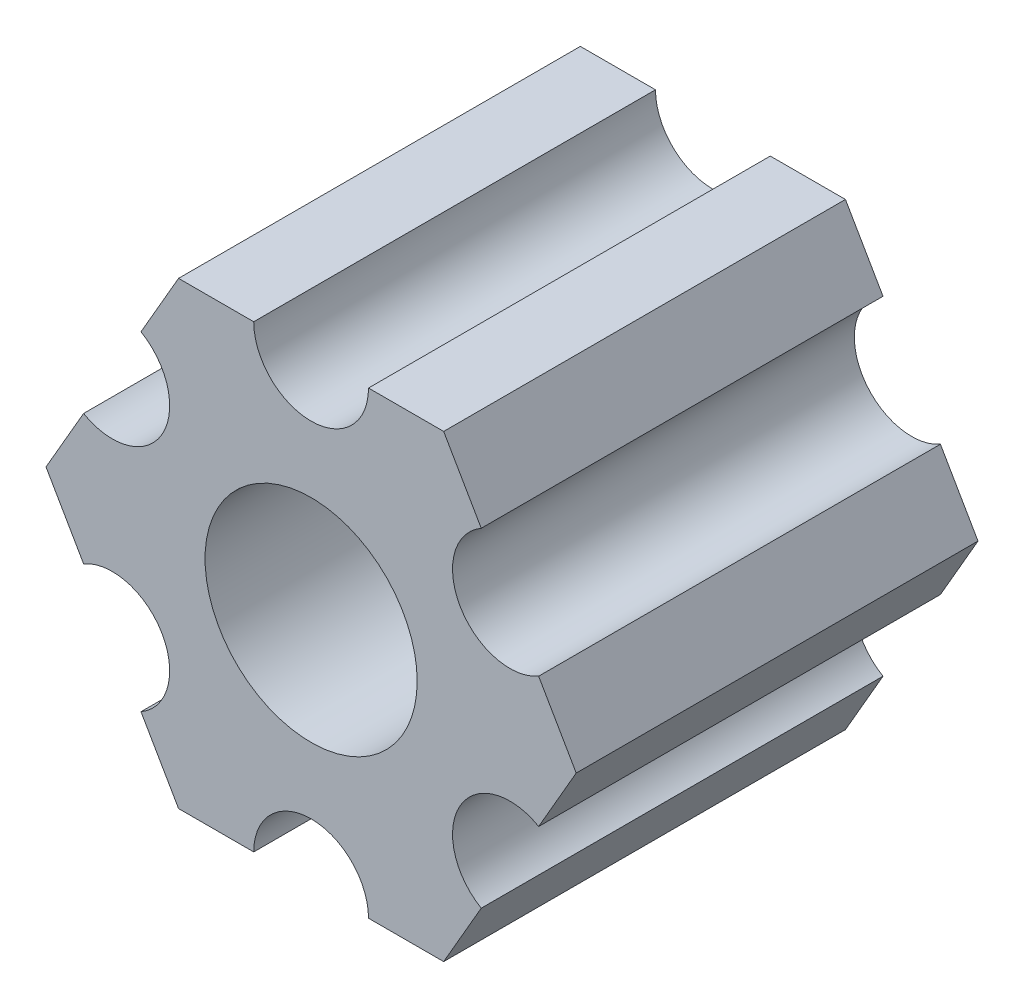
ISO-10303-21;
HEADER;
FILE_DESCRIPTION(('STEP AP214'),'2;1');
FILE_NAME('part.step','',(''),(''),'','','');
FILE_SCHEMA(('AUTOMOTIVE_DESIGN { 1 0 10303 214 1 1 1 1 }'));
ENDSEC;
DATA;
#1=APPLICATION_CONTEXT('core data for automotive mechanical design processes');
#2=APPLICATION_PROTOCOL_DEFINITION('international standard','automotive_design',2000,#1);
#3=PRODUCT_CONTEXT('',#1,'mechanical');
#4=PRODUCT('Part','Part','',(#3));
#5=PRODUCT_RELATED_PRODUCT_CATEGORY('part','',(#4));
#6=PRODUCT_DEFINITION_FORMATION('','',#4);
#7=PRODUCT_DEFINITION_CONTEXT('part definition',#1,'design');
#8=PRODUCT_DEFINITION('design','',#6,#7);
#9=PRODUCT_DEFINITION_SHAPE('','',#8);
#10=(LENGTH_UNIT() NAMED_UNIT(*) SI_UNIT(.MILLI.,.METRE.));
#11=(NAMED_UNIT(*) PLANE_ANGLE_UNIT() SI_UNIT($,.RADIAN.));
#12=(NAMED_UNIT(*) SI_UNIT($,.STERADIAN.) SOLID_ANGLE_UNIT());
#13=UNCERTAINTY_MEASURE_WITH_UNIT(LENGTH_MEASURE(1.E-05),#10,'distance_accuracy_value','');
#14=(GEOMETRIC_REPRESENTATION_CONTEXT(3) GLOBAL_UNCERTAINTY_ASSIGNED_CONTEXT((#13)) GLOBAL_UNIT_ASSIGNED_CONTEXT((#10,
#11,#12)) REPRESENTATION_CONTEXT('',''));
#15=CARTESIAN_POINT('',(0.,0.,0.));
#16=DIRECTION('',(0.,0.,1.));
#17=DIRECTION('',(1.,0.,0.));
#18=AXIS2_PLACEMENT_3D('',#15,#16,#17);
#19=CARTESIAN_POINT('',(5.49926150638083,-3.17499966684068,15.875));
#20=DIRECTION('',(0.,0.,-1.));
#21=DIRECTION('',(-1.,0.,0.));
#22=AXIS2_PLACEMENT_3D('',#19,#20,#21);
#23=CYLINDRICAL_SURFACE('',#22,1.58750000000001);
#24=DIRECTION('',(0.,0.,-1.));
#25=VECTOR('',#24,1.);
#26=CARTESIAN_POINT('',(6.29301142309098,-1.80018429024546,15.875));
#27=LINE('',#26,#25);
#28=CARTESIAN_POINT('',(6.29301142309098,-1.80018429024546,11.1125));
#29=VERTEX_POINT('',#28);
#30=CARTESIAN_POINT('',(6.29301142309098,-1.80018429024546,0.));
#31=VERTEX_POINT('',#30);
#32=EDGE_CURVE('E11',#29,#31,#27,.T.);
#33=ORIENTED_EDGE('',*,*,#32,.F.);
#34=CARTESIAN_POINT('',(5.49926150638083,-3.17499966684068,11.1125));
#35=DIRECTION('',(0.,0.,-1.));
#36=DIRECTION('',(1.,0.,0.));
#37=AXIS2_PLACEMENT_3D('',#34,#35,#36);
#38=CIRCLE('',#37,1.58750000000001);
#39=CARTESIAN_POINT('',(4.70551158967068,-4.54981504343589,11.1125));
#40=VERTEX_POINT('',#39);
#41=EDGE_CURVE('E271',#40,#29,#38,.T.);
#42=ORIENTED_EDGE('',*,*,#41,.F.);
#43=DIRECTION('',(0.,0.,-1.));
#44=VECTOR('',#43,1.);
#45=CARTESIAN_POINT('',(4.70551158967068,-4.54981504343589,15.875));
#46=LINE('',#45,#44);
#47=CARTESIAN_POINT('',(4.70551158967068,-4.54981504343589,0.));
#48=VERTEX_POINT('',#47);
#49=EDGE_CURVE('E199',#40,#48,#46,.T.);
#50=ORIENTED_EDGE('',*,*,#49,.T.);
#51=CARTESIAN_POINT('',(5.49926150638083,-3.17499966684068,0.));
#52=DIRECTION('',(0.,0.,1.));
#53=DIRECTION('',(1.,0.,0.));
#54=AXIS2_PLACEMENT_3D('',#51,#52,#53);
#55=CIRCLE('',#54,1.58750000000001);
#56=EDGE_CURVE('E273',#31,#48,#55,.T.);
#57=ORIENTED_EDGE('',*,*,#56,.F.);
#58=EDGE_LOOP('',(#33,#42,#50,#57));
#59=FACE_BOUND('',#58,.T.);
#60=ADVANCED_FACE('F32',(#59),#23,.F.);
#61=CARTESIAN_POINT('',(7.33234841870826,4.44212518856872E-07,15.875));
#62=DIRECTION('',(0.866025434075723,-0.499999947533953,0.));
#63=DIRECTION('',(0.499999947533953,0.866025434075723,0.));
#64=AXIS2_PLACEMENT_3D('',#61,#62,#63);
#65=PLANE('',#64);
#66=DIRECTION('',(0.,0.,-1.));
#67=VECTOR('',#66,1.);
#68=CARTESIAN_POINT('',(7.33234841870826,4.44212518856872E-07,15.875));
#69=LINE('',#68,#67);
#70=CARTESIAN_POINT('',(7.33234841870826,4.44212518856872E-07,11.1125));
#71=VERTEX_POINT('',#70);
#72=CARTESIAN_POINT('',(7.33234841870826,4.44212518856872E-07,0.));
#73=VERTEX_POINT('',#72);
#74=EDGE_CURVE('E40',#71,#73,#69,.T.);
#75=ORIENTED_EDGE('',*,*,#74,.F.);
#76=DIRECTION('',(0.499999947533953,0.866025434075723,0.));
#77=VECTOR('',#76,1.);
#78=CARTESIAN_POINT('',(7.33234841870826,4.44212518856872E-07,11.1125));
#79=LINE('',#78,#77);
#80=EDGE_CURVE('E270',#29,#71,#79,.T.);
#81=ORIENTED_EDGE('',*,*,#80,.F.);
#82=ORIENTED_EDGE('',*,*,#32,.T.);
#83=DIRECTION('',(-0.499999947533953,-0.866025434075723,0.));
#84=VECTOR('',#83,1.);
#85=CARTESIAN_POINT('',(7.33234841870826,4.44212518856872E-07,0.));
#86=LINE('',#85,#84);
#87=EDGE_CURVE('E200',#73,#31,#86,.T.);
#88=ORIENTED_EDGE('',*,*,#87,.F.);
#89=EDGE_LOOP('',(#75,#81,#82,#88));
#90=FACE_BOUND('',#89,.T.);
#91=ADVANCED_FACE('F269',(#90),#65,.T.);
#92=CARTESIAN_POINT('',(6.29301120497139,1.80018505273895,15.875));
#93=DIRECTION('',(0.866025373493145,0.500000052466056,0.));
#94=DIRECTION('',(-0.500000052466056,0.866025373493145,0.));
#95=AXIS2_PLACEMENT_3D('',#92,#93,#94);
#96=PLANE('',#95);
#97=DIRECTION('',(0.,0.,-1.));
#98=VECTOR('',#97,1.);
#99=CARTESIAN_POINT('',(6.29301120497139,1.80018505273895,15.875));
#100=LINE('',#99,#98);
#101=CARTESIAN_POINT('',(6.29301120497139,1.80018505273895,11.1125));
#102=VERTEX_POINT('',#101);
#103=CARTESIAN_POINT('',(6.29301120497139,1.80018505273895,0.));
#104=VERTEX_POINT('',#103);
#105=EDGE_CURVE('E216',#102,#104,#100,.T.);
#106=ORIENTED_EDGE('',*,*,#105,.F.);
#107=DIRECTION('',(-0.500000052466056,0.866025373493145,0.));
#108=VECTOR('',#107,1.);
#109=CARTESIAN_POINT('',(6.29301120497139,1.80018505273895,11.1125));
#110=LINE('',#109,#108);
#111=EDGE_CURVE('E268',#71,#102,#110,.T.);
#112=ORIENTED_EDGE('',*,*,#111,.F.);
#113=ORIENTED_EDGE('',*,*,#74,.T.);
#114=DIRECTION('',(0.500000052466056,-0.866025373493145,0.));
#115=VECTOR('',#114,1.);
#116=CARTESIAN_POINT('',(6.29301120497139,1.80018505273895,0.));
#117=LINE('',#116,#115);
#118=EDGE_CURVE('E206',#104,#73,#117,.T.);
#119=ORIENTED_EDGE('',*,*,#118,.F.);
#120=EDGE_LOOP('',(#106,#112,#113,#119));
#121=FACE_BOUND('',#120,.T.);
#122=ADVANCED_FACE('F266',(#121),#96,.T.);
#123=CARTESIAN_POINT('',(5.49926112168152,3.17500033315931,15.875));
#124=DIRECTION('',(0.,0.,-1.));
#125=DIRECTION('',(-1.,0.,0.));
#126=AXIS2_PLACEMENT_3D('',#123,#124,#125);
#127=CYLINDRICAL_SURFACE('',#126,1.5875);
#128=DIRECTION('',(0.,0.,-1.));
#129=VECTOR('',#128,1.);
#130=CARTESIAN_POINT('',(4.70551103839166,4.54981561357968,15.875));
#131=LINE('',#130,#129);
#132=CARTESIAN_POINT('',(4.70551103839166,4.54981561357968,11.1125));
#133=VERTEX_POINT('',#132);
#134=CARTESIAN_POINT('',(4.70551103839166,4.54981561357968,0.));
#135=VERTEX_POINT('',#134);
#136=EDGE_CURVE('E218',#133,#135,#131,.T.);
#137=ORIENTED_EDGE('',*,*,#136,.F.);
#138=CARTESIAN_POINT('',(5.49926112168152,3.17500033315931,11.1125));
#139=DIRECTION('',(0.,0.,-1.));
#140=DIRECTION('',(1.,0.,0.));
#141=AXIS2_PLACEMENT_3D('',#138,#139,#140);
#142=CIRCLE('',#141,1.5875);
#143=EDGE_CURVE('E263',#102,#133,#142,.T.);
#144=ORIENTED_EDGE('',*,*,#143,.F.);
#145=ORIENTED_EDGE('',*,*,#105,.T.);
#146=CARTESIAN_POINT('',(5.49926112168152,3.17500033315931,0.));
#147=DIRECTION('',(0.,0.,1.));
#148=DIRECTION('',(1.,0.,0.));
#149=AXIS2_PLACEMENT_3D('',#146,#147,#148);
#150=CIRCLE('',#149,1.5875);
#151=EDGE_CURVE('E211',#135,#104,#150,.T.);
#152=ORIENTED_EDGE('',*,*,#151,.F.);
#153=EDGE_LOOP('',(#137,#144,#145,#152));
#154=FACE_BOUND('',#153,.T.);
#155=ADVANCED_FACE('F260',(#154),#127,.F.);
#156=CARTESIAN_POINT('',(3.66617382465472,6.35000022210622,15.875));
#157=DIRECTION('',(0.866025373493145,0.500000052466056,0.));
#158=DIRECTION('',(-0.500000052466056,0.866025373493145,0.));
#159=AXIS2_PLACEMENT_3D('',#156,#157,#158);
#160=PLANE('',#159);
#161=DIRECTION('',(0.,0.,-1.));
#162=VECTOR('',#161,1.);
#163=CARTESIAN_POINT('',(3.66617382465472,6.35000022210622,15.875));
#164=LINE('',#163,#162);
#165=CARTESIAN_POINT('',(3.66617382465472,6.35000022210622,11.1125));
#166=VERTEX_POINT('',#165);
#167=CARTESIAN_POINT('',(3.66617382465472,6.35000022210622,0.));
#168=VERTEX_POINT('',#167);
#169=EDGE_CURVE('E220',#166,#168,#164,.T.);
#170=ORIENTED_EDGE('',*,*,#169,.F.);
#171=DIRECTION('',(-0.500000052466057,0.866025373493145,0.));
#172=VECTOR('',#171,1.);
#173=CARTESIAN_POINT('',(3.66617382465472,6.35000022210622,11.1125));
#174=LINE('',#173,#172);
#175=EDGE_CURVE('E322',#133,#166,#174,.T.);
#176=ORIENTED_EDGE('',*,*,#175,.F.);
#177=ORIENTED_EDGE('',*,*,#136,.T.);
#178=DIRECTION('',(0.500000052466056,-0.866025373493145,0.));
#179=VECTOR('',#178,1.);
#180=CARTESIAN_POINT('',(3.66617382465472,6.35000022210622,0.));
#181=LINE('',#180,#179);
#182=EDGE_CURVE('E252',#168,#135,#181,.T.);
#183=ORIENTED_EDGE('',*,*,#182,.F.);
#184=EDGE_LOOP('',(#170,#176,#177,#183));
#185=FACE_BOUND('',#184,.T.);
#186=ADVANCED_FACE('F358',(#185),#160,.T.);
#187=CARTESIAN_POINT('',(1.58749961530066,6.35000022210623,15.875));
#188=DIRECTION('',(0.,1.,0.));
#189=DIRECTION('',(-1.,0.,0.));
#190=AXIS2_PLACEMENT_3D('',#187,#188,#189);
#191=PLANE('',#190);
#192=DIRECTION('',(0.,0.,-1.));
#193=VECTOR('',#192,1.);
#194=CARTESIAN_POINT('',(1.58749961530066,6.35000022210623,15.875));
#195=LINE('',#194,#193);
#196=CARTESIAN_POINT('',(1.58749961530066,6.35000022210623,11.1125));
#197=VERTEX_POINT('',#196);
#198=CARTESIAN_POINT('',(1.58749961530066,6.35000022210623,0.));
#199=VERTEX_POINT('',#198);
#200=EDGE_CURVE('E222',#197,#199,#195,.T.);
#201=ORIENTED_EDGE('',*,*,#200,.F.);
#202=DIRECTION('',(-1.,0.,0.));
#203=VECTOR('',#202,1.);
#204=CARTESIAN_POINT('',(1.58749961530066,6.35000022210623,11.1125));
#205=LINE('',#204,#203);
#206=EDGE_CURVE('E324',#166,#197,#205,.T.);
#207=ORIENTED_EDGE('',*,*,#206,.F.);
#208=ORIENTED_EDGE('',*,*,#169,.T.);
#209=DIRECTION('',(1.,0.,0.));
#210=VECTOR('',#209,1.);
#211=CARTESIAN_POINT('',(1.58749961530066,6.35000022210623,0.));
#212=LINE('',#211,#210);
#213=EDGE_CURVE('E249',#199,#168,#212,.T.);
#214=ORIENTED_EDGE('',*,*,#213,.F.);
#215=EDGE_LOOP('',(#201,#207,#208,#214));
#216=FACE_BOUND('',#215,.T.);
#217=ADVANCED_FACE('F361',(#216),#191,.T.);
#218=CARTESIAN_POINT('',(-3.84699344941095E-07,6.35000022210623,15.875));
#219=DIRECTION('',(0.,0.,-1.));
#220=DIRECTION('',(-1.,0.,0.));
#221=AXIS2_PLACEMENT_3D('',#218,#219,#220);
#222=CYLINDRICAL_SURFACE('',#221,1.5875);
#223=DIRECTION('',(0.,0.,-1.));
#224=VECTOR('',#223,1.);
#225=CARTESIAN_POINT('',(-1.58750038469935,6.35000022210623,15.875));
#226=LINE('',#225,#224);
#227=CARTESIAN_POINT('',(-1.58750038469935,6.35000022210623,11.1125));
#228=VERTEX_POINT('',#227);
#229=CARTESIAN_POINT('',(-1.58750038469935,6.35000022210623,0.));
#230=VERTEX_POINT('',#229);
#231=EDGE_CURVE('E224',#228,#230,#226,.T.);
#232=ORIENTED_EDGE('',*,*,#231,.F.);
#233=CARTESIAN_POINT('',(-3.84699344941095E-07,6.35000022210623,11.1125));
#234=DIRECTION('',(0.,0.,-1.));
#235=DIRECTION('',(1.,0.,0.));
#236=AXIS2_PLACEMENT_3D('',#233,#234,#235);
#237=CIRCLE('',#236,1.5875);
#238=EDGE_CURVE('E326',#197,#228,#237,.T.);
#239=ORIENTED_EDGE('',*,*,#238,.F.);
#240=ORIENTED_EDGE('',*,*,#200,.T.);
#241=CARTESIAN_POINT('',(-3.84699344941095E-07,6.35000022210623,0.));
#242=DIRECTION('',(0.,0.,1.));
#243=DIRECTION('',(1.,0.,0.));
#244=AXIS2_PLACEMENT_3D('',#241,#242,#243);
#245=CIRCLE('',#244,1.5875);
#246=EDGE_CURVE('E240',#230,#199,#245,.T.);
#247=ORIENTED_EDGE('',*,*,#246,.F.);
#248=EDGE_LOOP('',(#232,#239,#240,#247));
#249=FACE_BOUND('',#248,.T.);
#250=ADVANCED_FACE('F365',(#249),#222,.F.);
#251=CARTESIAN_POINT('',(-3.66617452134701,6.35000022210623,15.875));
#252=DIRECTION('',(0.,1.,0.));
#253=DIRECTION('',(0.,0.,1.));
#254=AXIS2_PLACEMENT_3D('',#251,#252,#253);
#255=PLANE('',#254);
#256=DIRECTION('',(0.,0.,-1.));
#257=VECTOR('',#256,1.);
#258=CARTESIAN_POINT('',(-3.66617452134701,6.35000022210623,15.875));
#259=LINE('',#258,#257);
#260=CARTESIAN_POINT('',(-3.66617452134701,6.35000022210623,11.1125));
#261=VERTEX_POINT('',#260);
#262=CARTESIAN_POINT('',(-3.66617452134701,6.35000022210623,0.));
#263=VERTEX_POINT('',#262);
#264=EDGE_CURVE('E183',#261,#263,#259,.T.);
#265=ORIENTED_EDGE('',*,*,#264,.F.);
#266=DIRECTION('',(-1.,0.,0.));
#267=VECTOR('',#266,1.);
#268=CARTESIAN_POINT('',(-3.66617452134701,6.35000022210623,11.1125));
#269=LINE('',#268,#267);
#270=EDGE_CURVE('E328',#228,#261,#269,.T.);
#271=ORIENTED_EDGE('',*,*,#270,.F.);
#272=ORIENTED_EDGE('',*,*,#231,.T.);
#273=DIRECTION('',(1.,0.,0.));
#274=VECTOR('',#273,1.);
#275=CARTESIAN_POINT('',(-3.66617452134701,6.35000022210623,0.));
#276=LINE('',#275,#274);
#277=EDGE_CURVE('E235',#263,#230,#276,.T.);
#278=ORIENTED_EDGE('',*,*,#277,.F.);
#279=EDGE_LOOP('',(#265,#271,#272,#278));
#280=FACE_BOUND('',#279,.T.);
#281=ADVANCED_FACE('F236',(#280),#255,.T.);
#282=CARTESIAN_POINT('',(-4.70551145677116,4.54981548085265,15.875));
#283=DIRECTION('',(-0.866025447431971,0.499999924400249,0.));
#284=DIRECTION('',(-0.499999924400249,-0.866025447431971,0.));
#285=AXIS2_PLACEMENT_3D('',#282,#283,#284);
#286=PLANE('',#285);
#287=DIRECTION('',(0.,0.,-1.));
#288=VECTOR('',#287,1.);
#289=CARTESIAN_POINT('',(-4.70551145677116,4.54981548085265,15.875));
#290=LINE('',#289,#288);
#291=CARTESIAN_POINT('',(-4.70551145677116,4.54981548085265,11.1125));
#292=VERTEX_POINT('',#291);
#293=CARTESIAN_POINT('',(-4.70551145677116,4.54981548085265,0.));
#294=VERTEX_POINT('',#293);
#295=EDGE_CURVE('E181',#292,#294,#290,.T.);
#296=ORIENTED_EDGE('',*,*,#295,.F.);
#297=DIRECTION('',(-0.499999924400249,-0.866025447431971,0.));
#298=VECTOR('',#297,1.);
#299=CARTESIAN_POINT('',(-4.70551145677116,4.54981548085265,11.1125));
#300=LINE('',#299,#298);
#301=EDGE_CURVE('E163',#261,#292,#300,.T.);
#302=ORIENTED_EDGE('',*,*,#301,.F.);
#303=ORIENTED_EDGE('',*,*,#264,.T.);
#304=DIRECTION('',(0.499999924400249,0.866025447431971,0.));
#305=VECTOR('',#304,1.);
#306=CARTESIAN_POINT('',(-4.70551145677116,4.54981548085265,0.));
#307=LINE('',#306,#305);
#308=EDGE_CURVE('E231',#294,#263,#307,.T.);
#309=ORIENTED_EDGE('',*,*,#308,.F.);
#310=EDGE_LOOP('',(#296,#302,#303,#309));
#311=FACE_BOUND('',#310,.T.);
#312=ADVANCED_FACE('F229',(#311),#286,.T.);
#313=CARTESIAN_POINT('',(-5.49926133675655,3.17500008305439,15.875));
#314=DIRECTION('',(0.,0.,-1.));
#315=DIRECTION('',(-1.,0.,0.));
#316=AXIS2_PLACEMENT_3D('',#313,#314,#315);
#317=CYLINDRICAL_SURFACE('',#316,1.5875);
#318=DIRECTION('',(0.,0.,-1.));
#319=VECTOR('',#318,1.);
#320=CARTESIAN_POINT('',(-6.29301121674195,1.80018468525613,15.875));
#321=LINE('',#320,#319);
#322=CARTESIAN_POINT('',(-6.29301121674195,1.80018468525613,11.1125));
#323=VERTEX_POINT('',#322);
#324=CARTESIAN_POINT('',(-6.29301121674195,1.80018468525613,0.));
#325=VERTEX_POINT('',#324);
#326=EDGE_CURVE('E172',#323,#325,#321,.T.);
#327=ORIENTED_EDGE('',*,*,#326,.F.);
#328=CARTESIAN_POINT('',(-5.49926133675655,3.17500008305439,11.1125));
#329=DIRECTION('',(0.,0.,-1.));
#330=DIRECTION('',(1.,0.,0.));
#331=AXIS2_PLACEMENT_3D('',#328,#329,#330);
#332=CIRCLE('',#331,1.5875);
#333=EDGE_CURVE('E156',#292,#323,#332,.T.);
#334=ORIENTED_EDGE('',*,*,#333,.F.);
#335=ORIENTED_EDGE('',*,*,#295,.T.);
#336=CARTESIAN_POINT('',(-5.49926133675655,3.17500008305439,0.));
#337=DIRECTION('',(0.,0.,1.));
#338=DIRECTION('',(1.,0.,0.));
#339=AXIS2_PLACEMENT_3D('',#336,#337,#338);
#340=CIRCLE('',#339,1.5875);
#341=EDGE_CURVE('E179',#325,#294,#340,.T.);
#342=ORIENTED_EDGE('',*,*,#341,.F.);
#343=EDGE_LOOP('',(#327,#334,#335,#342));
#344=FACE_BOUND('',#343,.T.);
#345=ADVANCED_FACE('F177',(#344),#317,.F.);
#346=CARTESIAN_POINT('',(-7.33234807945963,6.99338729030344E-08,15.875));
#347=DIRECTION('',(-0.866025447431971,0.499999924400249,0.));
#348=DIRECTION('',(-0.499999924400249,-0.866025447431971,0.));
#349=AXIS2_PLACEMENT_3D('',#346,#347,#348);
#350=PLANE('',#349);
#351=DIRECTION('',(0.,0.,-1.));
#352=VECTOR('',#351,1.);
#353=CARTESIAN_POINT('',(-7.33234807945963,6.99338729030344E-08,15.875));
#354=LINE('',#353,#352);
#355=CARTESIAN_POINT('',(-7.33234807945963,6.99338729030344E-08,11.1125));
#356=VERTEX_POINT('',#355);
#357=CARTESIAN_POINT('',(-7.33234807945963,6.99338729030344E-08,0.));
#358=VERTEX_POINT('',#357);
#359=EDGE_CURVE('E174',#356,#358,#354,.T.);
#360=ORIENTED_EDGE('',*,*,#359,.F.);
#361=DIRECTION('',(-0.499999924400249,-0.866025447431971,0.));
#362=VECTOR('',#361,1.);
#363=CARTESIAN_POINT('',(-7.33234807945963,6.99338729030344E-08,11.1125));
#364=LINE('',#363,#362);
#365=EDGE_CURVE('E160',#323,#356,#364,.T.);
#366=ORIENTED_EDGE('',*,*,#365,.F.);
#367=ORIENTED_EDGE('',*,*,#326,.T.);
#368=DIRECTION('',(0.499999924400249,0.866025447431971,0.));
#369=VECTOR('',#368,1.);
#370=CARTESIAN_POINT('',(-7.33234807945963,6.99338729030344E-08,0.));
#371=LINE('',#370,#369);
#372=EDGE_CURVE('E244',#358,#325,#371,.T.);
#373=ORIENTED_EDGE('',*,*,#372,.F.);
#374=EDGE_LOOP('',(#360,#366,#367,#373));
#375=FACE_BOUND('',#374,.T.);
#376=ADVANCED_FACE('F170',(#375),#350,.T.);
#377=CARTESIAN_POINT('',(-6.29301096189761,-1.80018459411914,15.875));
#378=DIRECTION('',(-0.866025400205645,-0.500000006198653,0.));
#379=DIRECTION('',(0.500000006198653,-0.866025400205645,0.));
#380=AXIS2_PLACEMENT_3D('',#377,#378,#379);
#381=PLANE('',#380);
#382=DIRECTION('',(0.,0.,-1.));
#383=VECTOR('',#382,1.);
#384=CARTESIAN_POINT('',(-6.29301096189761,-1.80018459411914,15.875));
#385=LINE('',#384,#383);
#386=CARTESIAN_POINT('',(-6.29301096189761,-1.80018459411914,11.1125));
#387=VERTEX_POINT('',#386);
#388=CARTESIAN_POINT('',(-6.29301096189761,-1.80018459411914,0.));
#389=VERTEX_POINT('',#388);
#390=EDGE_CURVE('E185',#387,#389,#385,.T.);
#391=ORIENTED_EDGE('',*,*,#390,.F.);
#392=DIRECTION('',(0.500000006198653,-0.866025400205645,0.));
#393=VECTOR('',#392,1.);
#394=CARTESIAN_POINT('',(-6.29301096189761,-1.80018459411914,11.1125));
#395=LINE('',#394,#393);
#396=EDGE_CURVE('E175',#356,#387,#395,.T.);
#397=ORIENTED_EDGE('',*,*,#396,.F.);
#398=ORIENTED_EDGE('',*,*,#359,.T.);
#399=DIRECTION('',(-0.500000006198653,0.866025400205645,0.));
#400=VECTOR('',#399,1.);
#401=CARTESIAN_POINT('',(-6.29301096189761,-1.80018459411914,0.));
#402=LINE('',#401,#400);
#403=EDGE_CURVE('E298',#389,#358,#402,.T.);
#404=ORIENTED_EDGE('',*,*,#403,.F.);
#405=EDGE_LOOP('',(#391,#397,#398,#404));
#406=FACE_BOUND('',#405,.T.);
#407=ADVANCED_FACE('F304',(#406),#381,.T.);
#408=CARTESIAN_POINT('',(-5.49926095205725,-3.1749999169456,15.875));
#409=DIRECTION('',(0.,0.,-1.));
#410=DIRECTION('',(-1.,0.,0.));
#411=AXIS2_PLACEMENT_3D('',#408,#409,#410);
#412=CYLINDRICAL_SURFACE('',#411,1.5875);
#413=DIRECTION('',(0.,0.,-1.));
#414=VECTOR('',#413,1.);
#415=CARTESIAN_POINT('',(-4.70551094221689,-4.54981523977206,15.875));
#416=LINE('',#415,#414);
#417=CARTESIAN_POINT('',(-4.70551094221689,-4.54981523977206,11.1125));
#418=VERTEX_POINT('',#417);
#419=CARTESIAN_POINT('',(-4.70551094221689,-4.54981523977206,0.));
#420=VERTEX_POINT('',#419);
#421=EDGE_CURVE('E190',#418,#420,#416,.T.);
#422=ORIENTED_EDGE('',*,*,#421,.F.);
#423=CARTESIAN_POINT('',(-5.49926095205725,-3.1749999169456,11.1125));
#424=DIRECTION('',(0.,0.,-1.));
#425=DIRECTION('',(1.,0.,0.));
#426=AXIS2_PLACEMENT_3D('',#423,#424,#425);
#427=CIRCLE('',#426,1.5875);
#428=EDGE_CURVE('E306',#387,#418,#427,.T.);
#429=ORIENTED_EDGE('',*,*,#428,.F.);
#430=ORIENTED_EDGE('',*,*,#390,.T.);
#431=CARTESIAN_POINT('',(-5.49926095205725,-3.1749999169456,0.));
#432=DIRECTION('',(0.,0.,1.));
#433=DIRECTION('',(1.,0.,0.));
#434=AXIS2_PLACEMENT_3D('',#431,#432,#433);
#435=CIRCLE('',#434,1.5875);
#436=EDGE_CURVE('E295',#420,#389,#435,.T.);
#437=ORIENTED_EDGE('',*,*,#436,.F.);
#438=EDGE_LOOP('',(#422,#429,#430,#437));
#439=FACE_BOUND('',#438,.T.);
#440=ADVANCED_FACE('F380',(#439),#412,.F.);
#441=CARTESIAN_POINT('',(-3.66617382465481,-6.34999990382519,15.875));
#442=DIRECTION('',(-0.866025400205644,-0.500000006198653,0.));
#443=DIRECTION('',(0.500000006198653,-0.866025400205645,0.));
#444=AXIS2_PLACEMENT_3D('',#441,#442,#443);
#445=PLANE('',#444);
#446=DIRECTION('',(0.,0.,-1.));
#447=VECTOR('',#446,1.);
#448=CARTESIAN_POINT('',(-3.66617382465481,-6.34999990382519,15.875));
#449=LINE('',#448,#447);
#450=CARTESIAN_POINT('',(-3.66617382465481,-6.34999990382519,11.1125));
#451=VERTEX_POINT('',#450);
#452=CARTESIAN_POINT('',(-3.66617382465481,-6.34999990382519,0.));
#453=VERTEX_POINT('',#452);
#454=EDGE_CURVE('E192',#451,#453,#449,.T.);
#455=ORIENTED_EDGE('',*,*,#454,.F.);
#456=DIRECTION('',(0.500000006198653,-0.866025400205644,0.));
#457=VECTOR('',#456,1.);
#458=CARTESIAN_POINT('',(-3.66617382465481,-6.34999990382519,11.1125));
#459=LINE('',#458,#457);
#460=EDGE_CURVE('E308',#418,#451,#459,.T.);
#461=ORIENTED_EDGE('',*,*,#460,.F.);
#462=ORIENTED_EDGE('',*,*,#421,.T.);
#463=DIRECTION('',(-0.500000006198653,0.866025400205644,0.));
#464=VECTOR('',#463,1.);
#465=CARTESIAN_POINT('',(-3.66617382465481,-6.34999990382519,0.));
#466=LINE('',#465,#464);
#467=EDGE_CURVE('E292',#453,#420,#466,.T.);
#468=ORIENTED_EDGE('',*,*,#467,.F.);
#469=EDGE_LOOP('',(#455,#461,#462,#468));
#470=FACE_BOUND('',#469,.T.);
#471=ADVANCED_FACE('F383',(#470),#445,.T.);
#472=CARTESIAN_POINT('',(-1.58749961530074,-6.34999990382519,15.875));
#473=DIRECTION('',(0.,-1.,0.));
#474=DIRECTION('',(1.,0.,0.));
#475=AXIS2_PLACEMENT_3D('',#472,#473,#474);
#476=PLANE('',#475);
#477=DIRECTION('',(0.,0.,-1.));
#478=VECTOR('',#477,1.);
#479=CARTESIAN_POINT('',(-1.58749961530074,-6.34999990382519,15.875));
#480=LINE('',#479,#478);
#481=CARTESIAN_POINT('',(-1.58749961530074,-6.34999990382519,11.1125));
#482=VERTEX_POINT('',#481);
#483=CARTESIAN_POINT('',(-1.58749961530074,-6.34999990382519,0.));
#484=VERTEX_POINT('',#483);
#485=EDGE_CURVE('E194',#482,#484,#480,.T.);
#486=ORIENTED_EDGE('',*,*,#485,.F.);
#487=DIRECTION('',(1.,0.,0.));
#488=VECTOR('',#487,1.);
#489=CARTESIAN_POINT('',(-1.58749961530074,-6.34999990382519,11.1125));
#490=LINE('',#489,#488);
#491=EDGE_CURVE('E312',#451,#482,#490,.T.);
#492=ORIENTED_EDGE('',*,*,#491,.F.);
#493=ORIENTED_EDGE('',*,*,#454,.T.);
#494=DIRECTION('',(-1.,0.,0.));
#495=VECTOR('',#494,1.);
#496=CARTESIAN_POINT('',(-1.58749961530074,-6.34999990382519,0.));
#497=LINE('',#496,#495);
#498=EDGE_CURVE('E289',#484,#453,#497,.T.);
#499=ORIENTED_EDGE('',*,*,#498,.F.);
#500=EDGE_LOOP('',(#486,#492,#493,#499));
#501=FACE_BOUND('',#500,.T.);
#502=ADVANCED_FACE('F387',(#501),#476,.T.);
#503=CARTESIAN_POINT('',(3.8469926204343E-07,-6.34999990382519,15.875));
#504=DIRECTION('',(0.,0.,-1.));
#505=DIRECTION('',(-1.,0.,0.));
#506=AXIS2_PLACEMENT_3D('',#503,#504,#505);
#507=CYLINDRICAL_SURFACE('',#506,1.5875);
#508=DIRECTION('',(0.,0.,-1.));
#509=VECTOR('',#508,1.);
#510=CARTESIAN_POINT('',(1.58750038469926,-6.34999990382518,15.875));
#511=LINE('',#510,#509);
#512=CARTESIAN_POINT('',(1.58750038469926,-6.34999990382518,11.1125));
#513=VERTEX_POINT('',#512);
#514=CARTESIAN_POINT('',(1.58750038469926,-6.34999990382518,0.));
#515=VERTEX_POINT('',#514);
#516=EDGE_CURVE('E196',#513,#515,#511,.T.);
#517=ORIENTED_EDGE('',*,*,#516,.F.);
#518=CARTESIAN_POINT('',(3.8469926204343E-07,-6.34999990382519,11.1125));
#519=DIRECTION('',(0.,0.,-1.));
#520=DIRECTION('',(1.,0.,0.));
#521=AXIS2_PLACEMENT_3D('',#518,#519,#520);
#522=CIRCLE('',#521,1.5875);
#523=EDGE_CURVE('E314',#482,#513,#522,.T.);
#524=ORIENTED_EDGE('',*,*,#523,.F.);
#525=ORIENTED_EDGE('',*,*,#485,.T.);
#526=CARTESIAN_POINT('',(3.8469926204343E-07,-6.34999990382519,0.));
#527=DIRECTION('',(0.,0.,1.));
#528=DIRECTION('',(1.,0.,0.));
#529=AXIS2_PLACEMENT_3D('',#526,#527,#528);
#530=CIRCLE('',#529,1.5875);
#531=EDGE_CURVE('E286',#515,#484,#530,.T.);
#532=ORIENTED_EDGE('',*,*,#531,.F.);
#533=EDGE_LOOP('',(#517,#524,#525,#532));
#534=FACE_BOUND('',#533,.T.);
#535=ADVANCED_FACE('F391',(#534),#507,.F.);
#536=CARTESIAN_POINT('',(3.66617452134693,-6.34999990382519,15.875));
#537=DIRECTION('',(0.,-1.,0.));
#538=DIRECTION('',(1.,0.,0.));
#539=AXIS2_PLACEMENT_3D('',#536,#537,#538);
#540=PLANE('',#539);
#541=DIRECTION('',(0.,0.,-1.));
#542=VECTOR('',#541,1.);
#543=CARTESIAN_POINT('',(3.66617452134693,-6.34999990382519,15.875));
#544=LINE('',#543,#542);
#545=CARTESIAN_POINT('',(3.66617452134693,-6.34999990382519,11.1125));
#546=VERTEX_POINT('',#545);
#547=CARTESIAN_POINT('',(3.66617452134693,-6.34999990382519,0.));
#548=VERTEX_POINT('',#547);
#549=EDGE_CURVE('E198',#546,#548,#544,.T.);
#550=ORIENTED_EDGE('',*,*,#549,.F.);
#551=DIRECTION('',(1.,0.,0.));
#552=VECTOR('',#551,1.);
#553=CARTESIAN_POINT('',(3.66617452134693,-6.34999990382519,11.1125));
#554=LINE('',#553,#552);
#555=EDGE_CURVE('E48',#513,#546,#554,.T.);
#556=ORIENTED_EDGE('',*,*,#555,.F.);
#557=ORIENTED_EDGE('',*,*,#516,.T.);
#558=DIRECTION('',(-1.,0.,0.));
#559=VECTOR('',#558,1.);
#560=CARTESIAN_POINT('',(3.66617452134693,-6.34999990382519,0.));
#561=LINE('',#560,#559);
#562=EDGE_CURVE('E278',#548,#515,#561,.T.);
#563=ORIENTED_EDGE('',*,*,#562,.F.);
#564=EDGE_LOOP('',(#550,#556,#557,#563));
#565=FACE_BOUND('',#564,.T.);
#566=ADVANCED_FACE('F343',(#565),#540,.T.);
#567=CARTESIAN_POINT('',(4.70551158967068,-4.54981504343589,15.875));
#568=DIRECTION('',(0.866025434075723,-0.499999947533953,0.));
#569=DIRECTION('',(0.499999947533953,0.866025434075723,0.));
#570=AXIS2_PLACEMENT_3D('',#567,#568,#569);
#571=PLANE('',#570);
#572=ORIENTED_EDGE('',*,*,#49,.F.);
#573=DIRECTION('',(0.499999947533953,0.866025434075723,0.));
#574=VECTOR('',#573,1.);
#575=CARTESIAN_POINT('',(4.70551158967068,-4.54981504343589,11.1125));
#576=LINE('',#575,#574);
#577=EDGE_CURVE('E317',#546,#40,#576,.T.);
#578=ORIENTED_EDGE('',*,*,#577,.F.);
#579=ORIENTED_EDGE('',*,*,#549,.T.);
#580=DIRECTION('',(-0.499999947533953,-0.866025434075723,0.));
#581=VECTOR('',#580,1.);
#582=CARTESIAN_POINT('',(4.70551158967068,-4.54981504343589,0.));
#583=LINE('',#582,#581);
#584=EDGE_CURVE('E275',#48,#548,#583,.T.);
#585=ORIENTED_EDGE('',*,*,#584,.F.);
#586=EDGE_LOOP('',(#572,#578,#579,#585));
#587=FACE_BOUND('',#586,.T.);
#588=ADVANCED_FACE('F334',(#587),#571,.T.);
#589=CARTESIAN_POINT('',(0.,0.,15.875));
#590=DIRECTION('',(0.,0.,-1.));
#591=DIRECTION('',(-1.,0.,0.));
#592=AXIS2_PLACEMENT_3D('',#589,#590,#591);
#593=CYLINDRICAL_SURFACE('',#592,2.9337);
#594=CARTESIAN_POINT('',(0.,0.,0.));
#595=DIRECTION('',(0.,0.,-1.));
#596=DIRECTION('',(1.,0.,0.));
#597=AXIS2_PLACEMENT_3D('',#594,#595,#596);
#598=CIRCLE('',#597,2.9337);
#599=CARTESIAN_POINT('',(2.9337,0.,0.));
#600=VERTEX_POINT('',#599);
#601=EDGE_CURVE('E276',#600,#600,#598,.T.);
#602=ORIENTED_EDGE('',*,*,#601,.T.);
#603=EDGE_LOOP('',(#602));
#604=FACE_BOUND('',#603,.T.);
#605=CARTESIAN_POINT('',(0.,0.,11.1125));
#606=DIRECTION('',(0.,0.,1.));
#607=DIRECTION('',(1.,0.,0.));
#608=AXIS2_PLACEMENT_3D('',#605,#606,#607);
#609=CIRCLE('',#608,2.9337);
#610=CARTESIAN_POINT('',(2.9337,0.,11.1125));
#611=VERTEX_POINT('',#610);
#612=EDGE_CURVE('E35',#611,#611,#609,.F.);
#613=ORIENTED_EDGE('',*,*,#612,.F.);
#614=EDGE_LOOP('',(#613));
#615=FACE_BOUND('',#614,.T.);
#616=ADVANCED_FACE('F332',(#604,#615),#593,.F.);
#617=CARTESIAN_POINT('',(5.49926150638083,-3.17499966684068,0.));
#618=DIRECTION('',(0.,0.,1.));
#619=DIRECTION('',(1.,0.,0.));
#620=AXIS2_PLACEMENT_3D('',#617,#618,#619);
#621=PLANE('',#620);
#622=ORIENTED_EDGE('',*,*,#601,.F.);
#623=EDGE_LOOP('',(#622));
#624=FACE_BOUND('',#623,.T.);
#625=ORIENTED_EDGE('',*,*,#56,.T.);
#626=ORIENTED_EDGE('',*,*,#584,.T.);
#627=ORIENTED_EDGE('',*,*,#562,.T.);
#628=ORIENTED_EDGE('',*,*,#531,.T.);
#629=ORIENTED_EDGE('',*,*,#498,.T.);
#630=ORIENTED_EDGE('',*,*,#467,.T.);
#631=ORIENTED_EDGE('',*,*,#436,.T.);
#632=ORIENTED_EDGE('',*,*,#403,.T.);
#633=ORIENTED_EDGE('',*,*,#372,.T.);
#634=ORIENTED_EDGE('',*,*,#341,.T.);
#635=ORIENTED_EDGE('',*,*,#308,.T.);
#636=ORIENTED_EDGE('',*,*,#277,.T.);
#637=ORIENTED_EDGE('',*,*,#246,.T.);
#638=ORIENTED_EDGE('',*,*,#213,.T.);
#639=ORIENTED_EDGE('',*,*,#182,.T.);
#640=ORIENTED_EDGE('',*,*,#151,.T.);
#641=ORIENTED_EDGE('',*,*,#118,.T.);
#642=ORIENTED_EDGE('',*,*,#87,.T.);
#643=EDGE_LOOP('',(#625,#626,#627,#628,#629,#630,#631,#632,#633,#634,#635,#636,#637,#638,#639,
#640,#641,#642));
#644=FACE_BOUND('',#643,.T.);
#645=ADVANCED_FACE('F242',(#624,#644),#621,.F.);
#646=CARTESIAN_POINT('',(-5.49926133675655,3.17500008305439,11.1125));
#647=DIRECTION('',(0.,0.,1.));
#648=DIRECTION('',(1.,0.,0.));
#649=AXIS2_PLACEMENT_3D('',#646,#647,#648);
#650=PLANE('',#649);
#651=ORIENTED_EDGE('',*,*,#333,.T.);
#652=ORIENTED_EDGE('',*,*,#365,.T.);
#653=ORIENTED_EDGE('',*,*,#396,.T.);
#654=ORIENTED_EDGE('',*,*,#428,.T.);
#655=ORIENTED_EDGE('',*,*,#460,.T.);
#656=ORIENTED_EDGE('',*,*,#491,.T.);
#657=ORIENTED_EDGE('',*,*,#523,.T.);
#658=ORIENTED_EDGE('',*,*,#555,.T.);
#659=ORIENTED_EDGE('',*,*,#577,.T.);
#660=ORIENTED_EDGE('',*,*,#41,.T.);
#661=ORIENTED_EDGE('',*,*,#80,.T.);
#662=ORIENTED_EDGE('',*,*,#111,.T.);
#663=ORIENTED_EDGE('',*,*,#143,.T.);
#664=ORIENTED_EDGE('',*,*,#175,.T.);
#665=ORIENTED_EDGE('',*,*,#206,.T.);
#666=ORIENTED_EDGE('',*,*,#238,.T.);
#667=ORIENTED_EDGE('',*,*,#270,.T.);
#668=ORIENTED_EDGE('',*,*,#301,.T.);
#669=EDGE_LOOP('',(#651,#652,#653,#654,#655,#656,#657,#658,#659,#660,#661,#662,#663,#664,#665,
#666,#667,#668));
#670=FACE_BOUND('',#669,.T.);
#671=ORIENTED_EDGE('',*,*,#612,.T.);
#672=EDGE_LOOP('',(#671));
#673=FACE_BOUND('',#672,.T.);
#674=ADVANCED_FACE('F158',(#670,#673),#650,.T.);
#675=CLOSED_SHELL('',(#60,#91,#122,#155,#186,#217,#250,#281,#312,#345,#376,#407,#440,#471,#502,
#535,#566,#588,#616,#645,#674));
#676=MANIFOLD_SOLID_BREP('B2',#675);
#677=ADVANCED_BREP_SHAPE_REPRESENTATION('',(#18,#676),#14);
#678=SHAPE_DEFINITION_REPRESENTATION(#9,#677);
ENDSEC;
END-ISO-10303-21;
